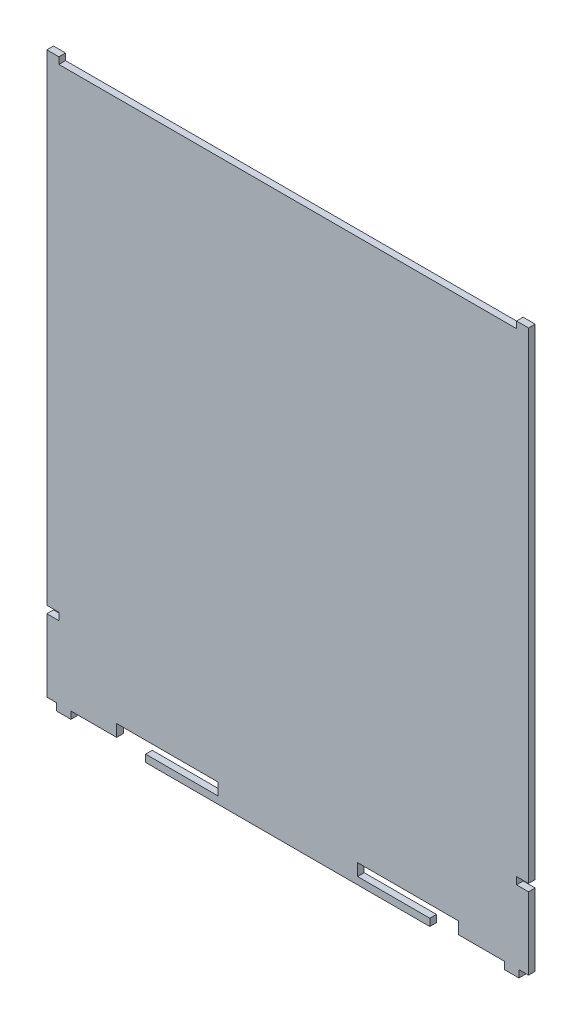
ISO-10303-21;
HEADER;
FILE_DESCRIPTION(('STEP AP214'),'2;1');
FILE_NAME('part.step','',(''),(''),'','','');
FILE_SCHEMA(('AUTOMOTIVE_DESIGN { 1 0 10303 214 1 1 1 1 }'));
ENDSEC;
DATA;
#1=APPLICATION_CONTEXT('core data for automotive mechanical design processes');
#2=APPLICATION_PROTOCOL_DEFINITION('international standard','automotive_design',2000,#1);
#3=PRODUCT_CONTEXT('',#1,'mechanical');
#4=PRODUCT('Part','Part','',(#3));
#5=PRODUCT_RELATED_PRODUCT_CATEGORY('part','',(#4));
#6=PRODUCT_DEFINITION_FORMATION('','',#4);
#7=PRODUCT_DEFINITION_CONTEXT('part definition',#1,'design');
#8=PRODUCT_DEFINITION('design','',#6,#7);
#9=PRODUCT_DEFINITION_SHAPE('','',#8);
#10=(LENGTH_UNIT() NAMED_UNIT(*) SI_UNIT(.MILLI.,.METRE.));
#11=(NAMED_UNIT(*) PLANE_ANGLE_UNIT() SI_UNIT($,.RADIAN.));
#12=(NAMED_UNIT(*) SI_UNIT($,.STERADIAN.) SOLID_ANGLE_UNIT());
#13=UNCERTAINTY_MEASURE_WITH_UNIT(LENGTH_MEASURE(1.E-05),#10,'distance_accuracy_value','');
#14=(GEOMETRIC_REPRESENTATION_CONTEXT(3) GLOBAL_UNCERTAINTY_ASSIGNED_CONTEXT((#13)) GLOBAL_UNIT_ASSIGNED_CONTEXT((#10,
#11,#12)) REPRESENTATION_CONTEXT('',''));
#15=CARTESIAN_POINT('',(0.,0.,0.));
#16=DIRECTION('',(0.,0.,1.));
#17=DIRECTION('',(1.,0.,0.));
#18=AXIS2_PLACEMENT_3D('',#15,#16,#17);
#19=CARTESIAN_POINT('',(200.,0.,2.75));
#20=DIRECTION('',(-1.,0.,0.));
#21=DIRECTION('',(0.,0.,1.));
#22=AXIS2_PLACEMENT_3D('',#19,#20,#21);
#23=PLANE('',#22);
#24=DIRECTION('',(0.,1.,0.));
#25=VECTOR('',#24,1.);
#26=CARTESIAN_POINT('',(200.,0.,0.));
#27=LINE('',#26,#25);
#28=CARTESIAN_POINT('',(200.,0.,0.));
#29=VERTEX_POINT('',#28);
#30=CARTESIAN_POINT('',(200.,30.,0.));
#31=VERTEX_POINT('',#30);
#32=EDGE_CURVE('E308',#29,#31,#27,.T.);
#33=ORIENTED_EDGE('',*,*,#32,.T.);
#34=DIRECTION('',(0.,0.,-1.));
#35=VECTOR('',#34,1.);
#36=CARTESIAN_POINT('',(200.,30.,2.75));
#37=LINE('',#36,#35);
#38=CARTESIAN_POINT('',(200.,30.,2.75));
#39=VERTEX_POINT('',#38);
#40=EDGE_CURVE('E11',#39,#31,#37,.T.);
#41=ORIENTED_EDGE('',*,*,#40,.F.);
#42=DIRECTION('',(0.,1.,0.));
#43=VECTOR('',#42,1.);
#44=CARTESIAN_POINT('',(200.,0.,2.75));
#45=LINE('',#44,#43);
#46=CARTESIAN_POINT('',(200.,0.,2.75));
#47=VERTEX_POINT('',#46);
#48=EDGE_CURVE('E434',#47,#39,#45,.T.);
#49=ORIENTED_EDGE('',*,*,#48,.F.);
#50=DIRECTION('',(0.,0.,-1.));
#51=VECTOR('',#50,1.);
#52=CARTESIAN_POINT('',(200.,0.,2.75));
#53=LINE('',#52,#51);
#54=EDGE_CURVE('E56',#47,#29,#53,.T.);
#55=ORIENTED_EDGE('',*,*,#54,.T.);
#56=EDGE_LOOP('',(#33,#41,#49,#55));
#57=FACE_BOUND('',#56,.T.);
#58=ADVANCED_FACE('F39',(#57),#23,.F.);
#59=CARTESIAN_POINT('',(0.,30.,2.75));
#60=DIRECTION('',(0.,-1.,0.));
#61=DIRECTION('',(0.,0.,-1.));
#62=AXIS2_PLACEMENT_3D('',#59,#60,#61);
#63=PLANE('',#62);
#64=DIRECTION('',(-1.,0.,0.));
#65=VECTOR('',#64,1.);
#66=CARTESIAN_POINT('',(0.,30.,0.));
#67=LINE('',#66,#65);
#68=CARTESIAN_POINT('',(195.,30.,0.));
#69=VERTEX_POINT('',#68);
#70=EDGE_CURVE('E311',#31,#69,#67,.T.);
#71=ORIENTED_EDGE('',*,*,#70,.T.);
#72=DIRECTION('',(0.,0.,-1.));
#73=VECTOR('',#72,1.);
#74=CARTESIAN_POINT('',(195.,30.,2.75));
#75=LINE('',#74,#73);
#76=CARTESIAN_POINT('',(195.,30.,2.75));
#77=VERTEX_POINT('',#76);
#78=EDGE_CURVE('E48',#77,#69,#75,.T.);
#79=ORIENTED_EDGE('',*,*,#78,.F.);
#80=DIRECTION('',(-1.,0.,0.));
#81=VECTOR('',#80,1.);
#82=CARTESIAN_POINT('',(0.,30.,2.75));
#83=LINE('',#82,#81);
#84=EDGE_CURVE('E178',#39,#77,#83,.T.);
#85=ORIENTED_EDGE('',*,*,#84,.F.);
#86=ORIENTED_EDGE('',*,*,#40,.T.);
#87=EDGE_LOOP('',(#71,#79,#85,#86));
#88=FACE_BOUND('',#87,.T.);
#89=ADVANCED_FACE('F684',(#88),#63,.F.);
#90=CARTESIAN_POINT('',(195.,0.,2.75));
#91=DIRECTION('',(-1.,0.,0.));
#92=DIRECTION('',(0.,0.,1.));
#93=AXIS2_PLACEMENT_3D('',#90,#91,#92);
#94=PLANE('',#93);
#95=DIRECTION('',(0.,1.,0.));
#96=VECTOR('',#95,1.);
#97=CARTESIAN_POINT('',(195.,0.,0.));
#98=LINE('',#97,#96);
#99=CARTESIAN_POINT('',(195.,33.,0.));
#100=VERTEX_POINT('',#99);
#101=EDGE_CURVE('E314',#69,#100,#98,.T.);
#102=ORIENTED_EDGE('',*,*,#101,.T.);
#103=DIRECTION('',(0.,0.,-1.));
#104=VECTOR('',#103,1.);
#105=CARTESIAN_POINT('',(195.,33.,2.75));
#106=LINE('',#105,#104);
#107=CARTESIAN_POINT('',(195.,33.,2.75));
#108=VERTEX_POINT('',#107);
#109=EDGE_CURVE('E540',#108,#100,#106,.T.);
#110=ORIENTED_EDGE('',*,*,#109,.F.);
#111=DIRECTION('',(0.,1.,0.));
#112=VECTOR('',#111,1.);
#113=CARTESIAN_POINT('',(195.,0.,2.75));
#114=LINE('',#113,#112);
#115=EDGE_CURVE('E550',#77,#108,#114,.T.);
#116=ORIENTED_EDGE('',*,*,#115,.F.);
#117=ORIENTED_EDGE('',*,*,#78,.T.);
#118=EDGE_LOOP('',(#102,#110,#116,#117));
#119=FACE_BOUND('',#118,.T.);
#120=ADVANCED_FACE('F548',(#119),#94,.F.);
#121=CARTESIAN_POINT('',(0.,33.,2.75));
#122=DIRECTION('',(0.,1.,0.));
#123=DIRECTION('',(0.,0.,1.));
#124=AXIS2_PLACEMENT_3D('',#121,#122,#123);
#125=PLANE('',#124);
#126=DIRECTION('',(1.,0.,0.));
#127=VECTOR('',#126,1.);
#128=CARTESIAN_POINT('',(0.,33.,0.));
#129=LINE('',#128,#127);
#130=CARTESIAN_POINT('',(200.,33.,0.));
#131=VERTEX_POINT('',#130);
#132=EDGE_CURVE('E317',#100,#131,#129,.T.);
#133=ORIENTED_EDGE('',*,*,#132,.T.);
#134=DIRECTION('',(0.,0.,-1.));
#135=VECTOR('',#134,1.);
#136=CARTESIAN_POINT('',(200.,33.,2.75));
#137=LINE('',#136,#135);
#138=CARTESIAN_POINT('',(200.,33.,2.75));
#139=VERTEX_POINT('',#138);
#140=EDGE_CURVE('E536',#139,#131,#137,.T.);
#141=ORIENTED_EDGE('',*,*,#140,.F.);
#142=DIRECTION('',(1.,0.,0.));
#143=VECTOR('',#142,1.);
#144=CARTESIAN_POINT('',(0.,33.,2.75));
#145=LINE('',#144,#143);
#146=EDGE_CURVE('E568',#108,#139,#145,.T.);
#147=ORIENTED_EDGE('',*,*,#146,.F.);
#148=ORIENTED_EDGE('',*,*,#109,.T.);
#149=EDGE_LOOP('',(#133,#141,#147,#148));
#150=FACE_BOUND('',#149,.T.);
#151=ADVANCED_FACE('F558',(#150),#125,.F.);
#152=CARTESIAN_POINT('',(200.,0.,2.75));
#153=DIRECTION('',(-1.,0.,0.));
#154=DIRECTION('',(0.,0.,1.));
#155=AXIS2_PLACEMENT_3D('',#152,#153,#154);
#156=PLANE('',#155);
#157=DIRECTION('',(0.,1.,0.));
#158=VECTOR('',#157,1.);
#159=CARTESIAN_POINT('',(200.,0.,0.));
#160=LINE('',#159,#158);
#161=CARTESIAN_POINT('',(200.,232.75,0.));
#162=VERTEX_POINT('',#161);
#163=EDGE_CURVE('E320',#131,#162,#160,.T.);
#164=ORIENTED_EDGE('',*,*,#163,.T.);
#165=DIRECTION('',(0.,0.,-1.));
#166=VECTOR('',#165,1.);
#167=CARTESIAN_POINT('',(200.,232.75,2.75));
#168=LINE('',#167,#166);
#169=CARTESIAN_POINT('',(200.,232.75,2.75));
#170=VERTEX_POINT('',#169);
#171=EDGE_CURVE('E532',#170,#162,#168,.T.);
#172=ORIENTED_EDGE('',*,*,#171,.F.);
#173=DIRECTION('',(0.,1.,0.));
#174=VECTOR('',#173,1.);
#175=CARTESIAN_POINT('',(200.,0.,2.75));
#176=LINE('',#175,#174);
#177=EDGE_CURVE('E564',#139,#170,#176,.T.);
#178=ORIENTED_EDGE('',*,*,#177,.F.);
#179=ORIENTED_EDGE('',*,*,#140,.T.);
#180=EDGE_LOOP('',(#164,#172,#178,#179));
#181=FACE_BOUND('',#180,.T.);
#182=ADVANCED_FACE('F562',(#181),#156,.F.);
#183=CARTESIAN_POINT('',(0.,232.75,2.75));
#184=DIRECTION('',(0.,-1.,0.));
#185=DIRECTION('',(0.,0.,-1.));
#186=AXIS2_PLACEMENT_3D('',#183,#184,#185);
#187=PLANE('',#186);
#188=DIRECTION('',(-1.,0.,0.));
#189=VECTOR('',#188,1.);
#190=CARTESIAN_POINT('',(0.,232.75,0.));
#191=LINE('',#190,#189);
#192=CARTESIAN_POINT('',(195.,232.75,0.));
#193=VERTEX_POINT('',#192);
#194=EDGE_CURVE('E323',#162,#193,#191,.T.);
#195=ORIENTED_EDGE('',*,*,#194,.T.);
#196=DIRECTION('',(0.,0.,-1.));
#197=VECTOR('',#196,1.);
#198=CARTESIAN_POINT('',(195.,232.75,2.75));
#199=LINE('',#198,#197);
#200=CARTESIAN_POINT('',(195.,232.75,2.75));
#201=VERTEX_POINT('',#200);
#202=EDGE_CURVE('E528',#201,#193,#199,.T.);
#203=ORIENTED_EDGE('',*,*,#202,.F.);
#204=DIRECTION('',(-1.,0.,0.));
#205=VECTOR('',#204,1.);
#206=CARTESIAN_POINT('',(0.,232.75,2.75));
#207=LINE('',#206,#205);
#208=EDGE_CURVE('E567',#170,#201,#207,.T.);
#209=ORIENTED_EDGE('',*,*,#208,.F.);
#210=ORIENTED_EDGE('',*,*,#171,.T.);
#211=EDGE_LOOP('',(#195,#203,#209,#210));
#212=FACE_BOUND('',#211,.T.);
#213=ADVANCED_FACE('F703',(#212),#187,.F.);
#214=CARTESIAN_POINT('',(195.,0.,2.75));
#215=DIRECTION('',(1.,0.,0.));
#216=DIRECTION('',(0.,0.,-1.));
#217=AXIS2_PLACEMENT_3D('',#214,#215,#216);
#218=PLANE('',#217);
#219=DIRECTION('',(0.,-1.,0.));
#220=VECTOR('',#219,1.);
#221=CARTESIAN_POINT('',(195.,0.,0.));
#222=LINE('',#221,#220);
#223=CARTESIAN_POINT('',(195.,230.,0.));
#224=VERTEX_POINT('',#223);
#225=EDGE_CURVE('E326',#193,#224,#222,.T.);
#226=ORIENTED_EDGE('',*,*,#225,.T.);
#227=DIRECTION('',(0.,0.,-1.));
#228=VECTOR('',#227,1.);
#229=CARTESIAN_POINT('',(195.,230.,2.75));
#230=LINE('',#229,#228);
#231=CARTESIAN_POINT('',(195.,230.,2.75));
#232=VERTEX_POINT('',#231);
#233=EDGE_CURVE('E525',#232,#224,#230,.T.);
#234=ORIENTED_EDGE('',*,*,#233,.F.);
#235=DIRECTION('',(0.,-1.,0.));
#236=VECTOR('',#235,1.);
#237=CARTESIAN_POINT('',(195.,0.,2.75));
#238=LINE('',#237,#236);
#239=EDGE_CURVE('E572',#201,#232,#238,.T.);
#240=ORIENTED_EDGE('',*,*,#239,.F.);
#241=ORIENTED_EDGE('',*,*,#202,.T.);
#242=EDGE_LOOP('',(#226,#234,#240,#241));
#243=FACE_BOUND('',#242,.T.);
#244=ADVANCED_FACE('F706',(#243),#218,.F.);
#245=CARTESIAN_POINT('',(0.,230.,2.75));
#246=DIRECTION('',(0.,1.,0.));
#247=DIRECTION('',(0.,0.,1.));
#248=AXIS2_PLACEMENT_3D('',#245,#246,#247);
#249=PLANE('',#248);
#250=DIRECTION('',(1.,0.,0.));
#251=VECTOR('',#250,1.);
#252=CARTESIAN_POINT('',(0.,230.,0.));
#253=LINE('',#252,#251);
#254=CARTESIAN_POINT('',(5.,230.,0.));
#255=VERTEX_POINT('',#254);
#256=EDGE_CURVE('E330',#255,#224,#253,.T.);
#257=ORIENTED_EDGE('',*,*,#256,.F.);
#258=DIRECTION('',(0.,0.,-1.));
#259=VECTOR('',#258,1.);
#260=CARTESIAN_POINT('',(5.,230.,2.75));
#261=LINE('',#260,#259);
#262=CARTESIAN_POINT('',(5.,230.,2.75));
#263=VERTEX_POINT('',#262);
#264=EDGE_CURVE('E522',#263,#255,#261,.T.);
#265=ORIENTED_EDGE('',*,*,#264,.F.);
#266=DIRECTION('',(1.,0.,0.));
#267=VECTOR('',#266,1.);
#268=CARTESIAN_POINT('',(0.,230.,2.75));
#269=LINE('',#268,#267);
#270=EDGE_CURVE('E579',#263,#232,#269,.T.);
#271=ORIENTED_EDGE('',*,*,#270,.T.);
#272=ORIENTED_EDGE('',*,*,#233,.T.);
#273=EDGE_LOOP('',(#257,#265,#271,#272));
#274=FACE_BOUND('',#273,.T.);
#275=ADVANCED_FACE('F710',(#274),#249,.T.);
#276=CARTESIAN_POINT('',(5.,0.,2.75));
#277=DIRECTION('',(1.,0.,0.));
#278=DIRECTION('',(0.,0.,-1.));
#279=AXIS2_PLACEMENT_3D('',#276,#277,#278);
#280=PLANE('',#279);
#281=DIRECTION('',(0.,-1.,0.));
#282=VECTOR('',#281,1.);
#283=CARTESIAN_POINT('',(5.,0.,0.));
#284=LINE('',#283,#282);
#285=CARTESIAN_POINT('',(5.,232.75,0.));
#286=VERTEX_POINT('',#285);
#287=EDGE_CURVE('E334',#286,#255,#284,.T.);
#288=ORIENTED_EDGE('',*,*,#287,.F.);
#289=DIRECTION('',(0.,0.,-1.));
#290=VECTOR('',#289,1.);
#291=CARTESIAN_POINT('',(5.,232.75,2.75));
#292=LINE('',#291,#290);
#293=CARTESIAN_POINT('',(5.,232.75,2.75));
#294=VERTEX_POINT('',#293);
#295=EDGE_CURVE('E519',#294,#286,#292,.T.);
#296=ORIENTED_EDGE('',*,*,#295,.F.);
#297=DIRECTION('',(0.,-1.,0.));
#298=VECTOR('',#297,1.);
#299=CARTESIAN_POINT('',(5.,0.,2.75));
#300=LINE('',#299,#298);
#301=EDGE_CURVE('E583',#294,#263,#300,.T.);
#302=ORIENTED_EDGE('',*,*,#301,.T.);
#303=ORIENTED_EDGE('',*,*,#264,.T.);
#304=EDGE_LOOP('',(#288,#296,#302,#303));
#305=FACE_BOUND('',#304,.T.);
#306=ADVANCED_FACE('F714',(#305),#280,.T.);
#307=CARTESIAN_POINT('',(0.,232.75,2.75));
#308=DIRECTION('',(0.,1.,0.));
#309=DIRECTION('',(0.,0.,1.));
#310=AXIS2_PLACEMENT_3D('',#307,#308,#309);
#311=PLANE('',#310);
#312=DIRECTION('',(1.,0.,0.));
#313=VECTOR('',#312,1.);
#314=CARTESIAN_POINT('',(0.,232.75,0.));
#315=LINE('',#314,#313);
#316=CARTESIAN_POINT('',(0.,232.75,0.));
#317=VERTEX_POINT('',#316);
#318=EDGE_CURVE('E338',#317,#286,#315,.T.);
#319=ORIENTED_EDGE('',*,*,#318,.F.);
#320=DIRECTION('',(0.,0.,-1.));
#321=VECTOR('',#320,1.);
#322=CARTESIAN_POINT('',(0.,232.75,2.75));
#323=LINE('',#322,#321);
#324=CARTESIAN_POINT('',(0.,232.75,2.75));
#325=VERTEX_POINT('',#324);
#326=EDGE_CURVE('E516',#325,#317,#323,.T.);
#327=ORIENTED_EDGE('',*,*,#326,.F.);
#328=DIRECTION('',(1.,0.,0.));
#329=VECTOR('',#328,1.);
#330=CARTESIAN_POINT('',(0.,232.75,2.75));
#331=LINE('',#330,#329);
#332=EDGE_CURVE('E587',#325,#294,#331,.T.);
#333=ORIENTED_EDGE('',*,*,#332,.T.);
#334=ORIENTED_EDGE('',*,*,#295,.T.);
#335=EDGE_LOOP('',(#319,#327,#333,#334));
#336=FACE_BOUND('',#335,.T.);
#337=ADVANCED_FACE('F718',(#336),#311,.T.);
#338=CARTESIAN_POINT('',(0.,0.,2.75));
#339=DIRECTION('',(-1.,0.,0.));
#340=DIRECTION('',(0.,0.,1.));
#341=AXIS2_PLACEMENT_3D('',#338,#339,#340);
#342=PLANE('',#341);
#343=DIRECTION('',(0.,1.,0.));
#344=VECTOR('',#343,1.);
#345=CARTESIAN_POINT('',(0.,0.,0.));
#346=LINE('',#345,#344);
#347=CARTESIAN_POINT('',(0.,33.,0.));
#348=VERTEX_POINT('',#347);
#349=EDGE_CURVE('E342',#348,#317,#346,.T.);
#350=ORIENTED_EDGE('',*,*,#349,.F.);
#351=DIRECTION('',(0.,0.,-1.));
#352=VECTOR('',#351,1.);
#353=CARTESIAN_POINT('',(0.,33.,2.75));
#354=LINE('',#353,#352);
#355=CARTESIAN_POINT('',(0.,33.,2.75));
#356=VERTEX_POINT('',#355);
#357=EDGE_CURVE('E513',#356,#348,#354,.T.);
#358=ORIENTED_EDGE('',*,*,#357,.F.);
#359=DIRECTION('',(0.,1.,0.));
#360=VECTOR('',#359,1.);
#361=CARTESIAN_POINT('',(0.,0.,2.75));
#362=LINE('',#361,#360);
#363=EDGE_CURVE('E591',#356,#325,#362,.T.);
#364=ORIENTED_EDGE('',*,*,#363,.T.);
#365=ORIENTED_EDGE('',*,*,#326,.T.);
#366=EDGE_LOOP('',(#350,#358,#364,#365));
#367=FACE_BOUND('',#366,.T.);
#368=ADVANCED_FACE('F722',(#367),#342,.T.);
#369=CARTESIAN_POINT('',(0.,33.,2.75));
#370=DIRECTION('',(0.,-1.,0.));
#371=DIRECTION('',(0.,0.,-1.));
#372=AXIS2_PLACEMENT_3D('',#369,#370,#371);
#373=PLANE('',#372);
#374=DIRECTION('',(-1.,0.,0.));
#375=VECTOR('',#374,1.);
#376=CARTESIAN_POINT('',(0.,33.,0.));
#377=LINE('',#376,#375);
#378=CARTESIAN_POINT('',(5.,33.,0.));
#379=VERTEX_POINT('',#378);
#380=EDGE_CURVE('E346',#379,#348,#377,.T.);
#381=ORIENTED_EDGE('',*,*,#380,.F.);
#382=DIRECTION('',(0.,0.,-1.));
#383=VECTOR('',#382,1.);
#384=CARTESIAN_POINT('',(5.,33.,2.75));
#385=LINE('',#384,#383);
#386=CARTESIAN_POINT('',(5.,33.,2.75));
#387=VERTEX_POINT('',#386);
#388=EDGE_CURVE('E510',#387,#379,#385,.T.);
#389=ORIENTED_EDGE('',*,*,#388,.F.);
#390=DIRECTION('',(-1.,0.,0.));
#391=VECTOR('',#390,1.);
#392=CARTESIAN_POINT('',(0.,33.,2.75));
#393=LINE('',#392,#391);
#394=EDGE_CURVE('E595',#387,#356,#393,.T.);
#395=ORIENTED_EDGE('',*,*,#394,.T.);
#396=ORIENTED_EDGE('',*,*,#357,.T.);
#397=EDGE_LOOP('',(#381,#389,#395,#396));
#398=FACE_BOUND('',#397,.T.);
#399=ADVANCED_FACE('F726',(#398),#373,.T.);
#400=CARTESIAN_POINT('',(5.,0.,2.75));
#401=DIRECTION('',(-1.,0.,0.));
#402=DIRECTION('',(0.,0.,1.));
#403=AXIS2_PLACEMENT_3D('',#400,#401,#402);
#404=PLANE('',#403);
#405=DIRECTION('',(0.,1.,0.));
#406=VECTOR('',#405,1.);
#407=CARTESIAN_POINT('',(5.,0.,0.));
#408=LINE('',#407,#406);
#409=CARTESIAN_POINT('',(5.,30.,0.));
#410=VERTEX_POINT('',#409);
#411=EDGE_CURVE('E350',#410,#379,#408,.T.);
#412=ORIENTED_EDGE('',*,*,#411,.F.);
#413=DIRECTION('',(0.,0.,-1.));
#414=VECTOR('',#413,1.);
#415=CARTESIAN_POINT('',(5.,30.,2.75));
#416=LINE('',#415,#414);
#417=CARTESIAN_POINT('',(5.,30.,2.75));
#418=VERTEX_POINT('',#417);
#419=EDGE_CURVE('E507',#418,#410,#416,.T.);
#420=ORIENTED_EDGE('',*,*,#419,.F.);
#421=DIRECTION('',(0.,1.,0.));
#422=VECTOR('',#421,1.);
#423=CARTESIAN_POINT('',(5.,0.,2.75));
#424=LINE('',#423,#422);
#425=EDGE_CURVE('E599',#418,#387,#424,.T.);
#426=ORIENTED_EDGE('',*,*,#425,.T.);
#427=ORIENTED_EDGE('',*,*,#388,.T.);
#428=EDGE_LOOP('',(#412,#420,#426,#427));
#429=FACE_BOUND('',#428,.T.);
#430=ADVANCED_FACE('F730',(#429),#404,.T.);
#431=CARTESIAN_POINT('',(0.,30.,2.75));
#432=DIRECTION('',(0.,1.,0.));
#433=DIRECTION('',(0.,0.,1.));
#434=AXIS2_PLACEMENT_3D('',#431,#432,#433);
#435=PLANE('',#434);
#436=DIRECTION('',(1.,0.,0.));
#437=VECTOR('',#436,1.);
#438=CARTESIAN_POINT('',(0.,30.,0.));
#439=LINE('',#438,#437);
#440=CARTESIAN_POINT('',(0.,30.,0.));
#441=VERTEX_POINT('',#440);
#442=EDGE_CURVE('E354',#441,#410,#439,.T.);
#443=ORIENTED_EDGE('',*,*,#442,.F.);
#444=DIRECTION('',(0.,0.,-1.));
#445=VECTOR('',#444,1.);
#446=CARTESIAN_POINT('',(0.,30.,2.75));
#447=LINE('',#446,#445);
#448=CARTESIAN_POINT('',(0.,30.,2.75));
#449=VERTEX_POINT('',#448);
#450=EDGE_CURVE('E504',#449,#441,#447,.T.);
#451=ORIENTED_EDGE('',*,*,#450,.F.);
#452=DIRECTION('',(1.,0.,0.));
#453=VECTOR('',#452,1.);
#454=CARTESIAN_POINT('',(0.,30.,2.75));
#455=LINE('',#454,#453);
#456=EDGE_CURVE('E603',#449,#418,#455,.T.);
#457=ORIENTED_EDGE('',*,*,#456,.T.);
#458=ORIENTED_EDGE('',*,*,#419,.T.);
#459=EDGE_LOOP('',(#443,#451,#457,#458));
#460=FACE_BOUND('',#459,.T.);
#461=ADVANCED_FACE('F734',(#460),#435,.T.);
#462=CARTESIAN_POINT('',(0.,0.,2.75));
#463=DIRECTION('',(-1.,0.,0.));
#464=DIRECTION('',(0.,0.,1.));
#465=AXIS2_PLACEMENT_3D('',#462,#463,#464);
#466=PLANE('',#465);
#467=DIRECTION('',(0.,1.,0.));
#468=VECTOR('',#467,1.);
#469=CARTESIAN_POINT('',(0.,0.,0.));
#470=LINE('',#469,#468);
#471=CARTESIAN_POINT('',(0.,0.,0.));
#472=VERTEX_POINT('',#471);
#473=EDGE_CURVE('E358',#472,#441,#470,.T.);
#474=ORIENTED_EDGE('',*,*,#473,.F.);
#475=DIRECTION('',(0.,0.,-1.));
#476=VECTOR('',#475,1.);
#477=CARTESIAN_POINT('',(0.,0.,2.75));
#478=LINE('',#477,#476);
#479=CARTESIAN_POINT('',(0.,0.,2.75));
#480=VERTEX_POINT('',#479);
#481=EDGE_CURVE('E501',#480,#472,#478,.T.);
#482=ORIENTED_EDGE('',*,*,#481,.F.);
#483=DIRECTION('',(0.,1.,0.));
#484=VECTOR('',#483,1.);
#485=CARTESIAN_POINT('',(0.,0.,2.75));
#486=LINE('',#485,#484);
#487=EDGE_CURVE('E607',#480,#449,#486,.T.);
#488=ORIENTED_EDGE('',*,*,#487,.T.);
#489=ORIENTED_EDGE('',*,*,#450,.T.);
#490=EDGE_LOOP('',(#474,#482,#488,#489));
#491=FACE_BOUND('',#490,.T.);
#492=ADVANCED_FACE('F738',(#491),#466,.T.);
#493=CARTESIAN_POINT('',(0.,0.,2.75));
#494=DIRECTION('',(0.,1.,0.));
#495=DIRECTION('',(0.,0.,1.));
#496=AXIS2_PLACEMENT_3D('',#493,#494,#495);
#497=PLANE('',#496);
#498=DIRECTION('',(1.,0.,0.));
#499=VECTOR('',#498,1.);
#500=CARTESIAN_POINT('',(0.,0.,0.));
#501=LINE('',#500,#499);
#502=CARTESIAN_POINT('',(4.,0.,0.));
#503=VERTEX_POINT('',#502);
#504=EDGE_CURVE('E362',#472,#503,#501,.T.);
#505=ORIENTED_EDGE('',*,*,#504,.T.);
#506=DIRECTION('',(0.,0.,-1.));
#507=VECTOR('',#506,1.);
#508=CARTESIAN_POINT('',(4.,0.,2.75));
#509=LINE('',#508,#507);
#510=CARTESIAN_POINT('',(4.,0.,2.75));
#511=VERTEX_POINT('',#510);
#512=EDGE_CURVE('E497',#511,#503,#509,.T.);
#513=ORIENTED_EDGE('',*,*,#512,.F.);
#514=DIRECTION('',(1.,0.,0.));
#515=VECTOR('',#514,1.);
#516=CARTESIAN_POINT('',(0.,0.,2.75));
#517=LINE('',#516,#515);
#518=EDGE_CURVE('E611',#480,#511,#517,.T.);
#519=ORIENTED_EDGE('',*,*,#518,.F.);
#520=ORIENTED_EDGE('',*,*,#481,.T.);
#521=EDGE_LOOP('',(#505,#513,#519,#520));
#522=FACE_BOUND('',#521,.T.);
#523=ADVANCED_FACE('F742',(#522),#497,.F.);
#524=CARTESIAN_POINT('',(4.,0.,2.75));
#525=DIRECTION('',(1.,0.,0.));
#526=DIRECTION('',(0.,0.,-1.));
#527=AXIS2_PLACEMENT_3D('',#524,#525,#526);
#528=PLANE('',#527);
#529=DIRECTION('',(0.,-1.,0.));
#530=VECTOR('',#529,1.);
#531=CARTESIAN_POINT('',(4.,0.,0.));
#532=LINE('',#531,#530);
#533=CARTESIAN_POINT('',(4.,-3.,0.));
#534=VERTEX_POINT('',#533);
#535=EDGE_CURVE('E365',#503,#534,#532,.T.);
#536=ORIENTED_EDGE('',*,*,#535,.T.);
#537=DIRECTION('',(0.,0.,-1.));
#538=VECTOR('',#537,1.);
#539=CARTESIAN_POINT('',(4.,-3.,2.75));
#540=LINE('',#539,#538);
#541=CARTESIAN_POINT('',(4.,-3.,2.75));
#542=VERTEX_POINT('',#541);
#543=EDGE_CURVE('E493',#542,#534,#540,.T.);
#544=ORIENTED_EDGE('',*,*,#543,.F.);
#545=DIRECTION('',(0.,-1.,0.));
#546=VECTOR('',#545,1.);
#547=CARTESIAN_POINT('',(4.,0.,2.75));
#548=LINE('',#547,#546);
#549=EDGE_CURVE('E614',#511,#542,#548,.T.);
#550=ORIENTED_EDGE('',*,*,#549,.F.);
#551=ORIENTED_EDGE('',*,*,#512,.T.);
#552=EDGE_LOOP('',(#536,#544,#550,#551));
#553=FACE_BOUND('',#552,.T.);
#554=ADVANCED_FACE('F746',(#553),#528,.F.);
#555=CARTESIAN_POINT('',(0.,-3.,2.75));
#556=DIRECTION('',(0.,1.,0.));
#557=DIRECTION('',(0.,0.,1.));
#558=AXIS2_PLACEMENT_3D('',#555,#556,#557);
#559=PLANE('',#558);
#560=DIRECTION('',(1.,0.,0.));
#561=VECTOR('',#560,1.);
#562=CARTESIAN_POINT('',(0.,-3.,0.));
#563=LINE('',#562,#561);
#564=CARTESIAN_POINT('',(10.,-3.,0.));
#565=VERTEX_POINT('',#564);
#566=EDGE_CURVE('E368',#534,#565,#563,.T.);
#567=ORIENTED_EDGE('',*,*,#566,.T.);
#568=DIRECTION('',(0.,0.,-1.));
#569=VECTOR('',#568,1.);
#570=CARTESIAN_POINT('',(10.,-3.,2.75));
#571=LINE('',#570,#569);
#572=CARTESIAN_POINT('',(10.,-3.,2.75));
#573=VERTEX_POINT('',#572);
#574=EDGE_CURVE('E489',#573,#565,#571,.T.);
#575=ORIENTED_EDGE('',*,*,#574,.F.);
#576=DIRECTION('',(1.,0.,0.));
#577=VECTOR('',#576,1.);
#578=CARTESIAN_POINT('',(0.,-3.,2.75));
#579=LINE('',#578,#577);
#580=EDGE_CURVE('E617',#542,#573,#579,.T.);
#581=ORIENTED_EDGE('',*,*,#580,.F.);
#582=ORIENTED_EDGE('',*,*,#543,.T.);
#583=EDGE_LOOP('',(#567,#575,#581,#582));
#584=FACE_BOUND('',#583,.T.);
#585=ADVANCED_FACE('F750',(#584),#559,.F.);
#586=CARTESIAN_POINT('',(10.,0.,2.75));
#587=DIRECTION('',(-1.,0.,0.));
#588=DIRECTION('',(0.,0.,1.));
#589=AXIS2_PLACEMENT_3D('',#586,#587,#588);
#590=PLANE('',#589);
#591=DIRECTION('',(0.,1.,0.));
#592=VECTOR('',#591,1.);
#593=CARTESIAN_POINT('',(10.,0.,0.));
#594=LINE('',#593,#592);
#595=CARTESIAN_POINT('',(10.,0.,0.));
#596=VERTEX_POINT('',#595);
#597=EDGE_CURVE('E371',#565,#596,#594,.T.);
#598=ORIENTED_EDGE('',*,*,#597,.T.);
#599=DIRECTION('',(0.,0.,-1.));
#600=VECTOR('',#599,1.);
#601=CARTESIAN_POINT('',(10.,0.,2.75));
#602=LINE('',#601,#600);
#603=CARTESIAN_POINT('',(10.,0.,2.75));
#604=VERTEX_POINT('',#603);
#605=EDGE_CURVE('E485',#604,#596,#602,.T.);
#606=ORIENTED_EDGE('',*,*,#605,.F.);
#607=DIRECTION('',(0.,1.,0.));
#608=VECTOR('',#607,1.);
#609=CARTESIAN_POINT('',(10.,0.,2.75));
#610=LINE('',#609,#608);
#611=EDGE_CURVE('E620',#573,#604,#610,.T.);
#612=ORIENTED_EDGE('',*,*,#611,.F.);
#613=ORIENTED_EDGE('',*,*,#574,.T.);
#614=EDGE_LOOP('',(#598,#606,#612,#613));
#615=FACE_BOUND('',#614,.T.);
#616=ADVANCED_FACE('F754',(#615),#590,.F.);
#617=CARTESIAN_POINT('',(0.,0.,2.75));
#618=DIRECTION('',(0.,1.,0.));
#619=DIRECTION('',(0.,0.,1.));
#620=AXIS2_PLACEMENT_3D('',#617,#618,#619);
#621=PLANE('',#620);
#622=DIRECTION('',(1.,0.,0.));
#623=VECTOR('',#622,1.);
#624=CARTESIAN_POINT('',(0.,0.,0.));
#625=LINE('',#624,#623);
#626=CARTESIAN_POINT('',(29.,0.,0.));
#627=VERTEX_POINT('',#626);
#628=EDGE_CURVE('E374',#596,#627,#625,.T.);
#629=ORIENTED_EDGE('',*,*,#628,.T.);
#630=DIRECTION('',(0.,0.,-1.));
#631=VECTOR('',#630,1.);
#632=CARTESIAN_POINT('',(29.,0.,2.75));
#633=LINE('',#632,#631);
#634=CARTESIAN_POINT('',(29.,0.,2.75));
#635=VERTEX_POINT('',#634);
#636=EDGE_CURVE('E481',#635,#627,#633,.T.);
#637=ORIENTED_EDGE('',*,*,#636,.F.);
#638=DIRECTION('',(1.,0.,0.));
#639=VECTOR('',#638,1.);
#640=CARTESIAN_POINT('',(0.,0.,2.75));
#641=LINE('',#640,#639);
#642=EDGE_CURVE('E623',#604,#635,#641,.T.);
#643=ORIENTED_EDGE('',*,*,#642,.F.);
#644=ORIENTED_EDGE('',*,*,#605,.T.);
#645=EDGE_LOOP('',(#629,#637,#643,#644));
#646=FACE_BOUND('',#645,.T.);
#647=ADVANCED_FACE('F758',(#646),#621,.F.);
#648=CARTESIAN_POINT('',(29.,0.,2.75));
#649=DIRECTION('',(-1.,0.,0.));
#650=DIRECTION('',(0.,0.,1.));
#651=AXIS2_PLACEMENT_3D('',#648,#649,#650);
#652=PLANE('',#651);
#653=DIRECTION('',(0.,1.,0.));
#654=VECTOR('',#653,1.);
#655=CARTESIAN_POINT('',(29.,0.,0.));
#656=LINE('',#655,#654);
#657=CARTESIAN_POINT('',(29.,5.,0.));
#658=VERTEX_POINT('',#657);
#659=EDGE_CURVE('E377',#627,#658,#656,.T.);
#660=ORIENTED_EDGE('',*,*,#659,.T.);
#661=DIRECTION('',(0.,0.,-1.));
#662=VECTOR('',#661,1.);
#663=CARTESIAN_POINT('',(29.,5.,2.75));
#664=LINE('',#663,#662);
#665=CARTESIAN_POINT('',(29.,5.,2.75));
#666=VERTEX_POINT('',#665);
#667=EDGE_CURVE('E477',#666,#658,#664,.T.);
#668=ORIENTED_EDGE('',*,*,#667,.F.);
#669=DIRECTION('',(0.,1.,0.));
#670=VECTOR('',#669,1.);
#671=CARTESIAN_POINT('',(29.,0.,2.75));
#672=LINE('',#671,#670);
#673=EDGE_CURVE('E626',#635,#666,#672,.T.);
#674=ORIENTED_EDGE('',*,*,#673,.F.);
#675=ORIENTED_EDGE('',*,*,#636,.T.);
#676=EDGE_LOOP('',(#660,#668,#674,#675));
#677=FACE_BOUND('',#676,.T.);
#678=ADVANCED_FACE('F762',(#677),#652,.F.);
#679=CARTESIAN_POINT('',(0.,5.,2.75));
#680=DIRECTION('',(0.,1.,0.));
#681=DIRECTION('',(0.,0.,1.));
#682=AXIS2_PLACEMENT_3D('',#679,#680,#681);
#683=PLANE('',#682);
#684=DIRECTION('',(1.,0.,0.));
#685=VECTOR('',#684,1.);
#686=CARTESIAN_POINT('',(0.,5.,0.));
#687=LINE('',#686,#685);
#688=CARTESIAN_POINT('',(71.,5.,0.));
#689=VERTEX_POINT('',#688);
#690=EDGE_CURVE('E380',#658,#689,#687,.T.);
#691=ORIENTED_EDGE('',*,*,#690,.T.);
#692=DIRECTION('',(0.,0.,-1.));
#693=VECTOR('',#692,1.);
#694=CARTESIAN_POINT('',(71.,5.,2.75));
#695=LINE('',#694,#693);
#696=CARTESIAN_POINT('',(71.,5.,2.75));
#697=VERTEX_POINT('',#696);
#698=EDGE_CURVE('E473',#697,#689,#695,.T.);
#699=ORIENTED_EDGE('',*,*,#698,.F.);
#700=DIRECTION('',(1.,0.,0.));
#701=VECTOR('',#700,1.);
#702=CARTESIAN_POINT('',(0.,5.,2.75));
#703=LINE('',#702,#701);
#704=EDGE_CURVE('E629',#666,#697,#703,.T.);
#705=ORIENTED_EDGE('',*,*,#704,.F.);
#706=ORIENTED_EDGE('',*,*,#667,.T.);
#707=EDGE_LOOP('',(#691,#699,#705,#706));
#708=FACE_BOUND('',#707,.T.);
#709=ADVANCED_FACE('F766',(#708),#683,.F.);
#710=CARTESIAN_POINT('',(71.,0.,2.75));
#711=DIRECTION('',(1.,0.,0.));
#712=DIRECTION('',(0.,0.,-1.));
#713=AXIS2_PLACEMENT_3D('',#710,#711,#712);
#714=PLANE('',#713);
#715=DIRECTION('',(0.,-1.,0.));
#716=VECTOR('',#715,1.);
#717=CARTESIAN_POINT('',(71.,0.,0.));
#718=LINE('',#717,#716);
#719=CARTESIAN_POINT('',(71.,0.,0.));
#720=VERTEX_POINT('',#719);
#721=EDGE_CURVE('E383',#689,#720,#718,.T.);
#722=ORIENTED_EDGE('',*,*,#721,.T.);
#723=DIRECTION('',(0.,0.,-1.));
#724=VECTOR('',#723,1.);
#725=CARTESIAN_POINT('',(71.,0.,2.75));
#726=LINE('',#725,#724);
#727=CARTESIAN_POINT('',(71.,0.,2.75));
#728=VERTEX_POINT('',#727);
#729=EDGE_CURVE('E469',#728,#720,#726,.T.);
#730=ORIENTED_EDGE('',*,*,#729,.F.);
#731=DIRECTION('',(0.,-1.,0.));
#732=VECTOR('',#731,1.);
#733=CARTESIAN_POINT('',(71.,0.,2.75));
#734=LINE('',#733,#732);
#735=EDGE_CURVE('E632',#697,#728,#734,.T.);
#736=ORIENTED_EDGE('',*,*,#735,.F.);
#737=ORIENTED_EDGE('',*,*,#698,.T.);
#738=EDGE_LOOP('',(#722,#730,#736,#737));
#739=FACE_BOUND('',#738,.T.);
#740=ADVANCED_FACE('F770',(#739),#714,.F.);
#741=CARTESIAN_POINT('',(0.,0.,2.75));
#742=DIRECTION('',(0.,-1.,0.));
#743=DIRECTION('',(0.,0.,-1.));
#744=AXIS2_PLACEMENT_3D('',#741,#742,#743);
#745=PLANE('',#744);
#746=DIRECTION('',(-1.,0.,0.));
#747=VECTOR('',#746,1.);
#748=CARTESIAN_POINT('',(0.,0.,0.));
#749=LINE('',#748,#747);
#750=CARTESIAN_POINT('',(41.,0.,0.));
#751=VERTEX_POINT('',#750);
#752=EDGE_CURVE('E386',#720,#751,#749,.T.);
#753=ORIENTED_EDGE('',*,*,#752,.T.);
#754=DIRECTION('',(0.,0.,-1.));
#755=VECTOR('',#754,1.);
#756=CARTESIAN_POINT('',(41.,0.,2.75));
#757=LINE('',#756,#755);
#758=CARTESIAN_POINT('',(41.,0.,2.75));
#759=VERTEX_POINT('',#758);
#760=EDGE_CURVE('E465',#759,#751,#757,.T.);
#761=ORIENTED_EDGE('',*,*,#760,.F.);
#762=DIRECTION('',(-1.,0.,0.));
#763=VECTOR('',#762,1.);
#764=CARTESIAN_POINT('',(0.,0.,2.75));
#765=LINE('',#764,#763);
#766=EDGE_CURVE('E635',#728,#759,#765,.T.);
#767=ORIENTED_EDGE('',*,*,#766,.F.);
#768=ORIENTED_EDGE('',*,*,#729,.T.);
#769=EDGE_LOOP('',(#753,#761,#767,#768));
#770=FACE_BOUND('',#769,.T.);
#771=ADVANCED_FACE('F774',(#770),#745,.F.);
#772=CARTESIAN_POINT('',(41.,0.,2.75));
#773=DIRECTION('',(1.,0.,0.));
#774=DIRECTION('',(0.,1.,0.));
#775=AXIS2_PLACEMENT_3D('',#772,#773,#774);
#776=PLANE('',#775);
#777=DIRECTION('',(0.,-1.,0.));
#778=VECTOR('',#777,1.);
#779=CARTESIAN_POINT('',(41.,0.,0.));
#780=LINE('',#779,#778);
#781=CARTESIAN_POINT('',(41.,-3.,0.));
#782=VERTEX_POINT('',#781);
#783=EDGE_CURVE('E389',#751,#782,#780,.T.);
#784=ORIENTED_EDGE('',*,*,#783,.T.);
#785=DIRECTION('',(0.,0.,-1.));
#786=VECTOR('',#785,1.);
#787=CARTESIAN_POINT('',(41.,-3.,2.75));
#788=LINE('',#787,#786);
#789=CARTESIAN_POINT('',(41.,-3.,2.75));
#790=VERTEX_POINT('',#789);
#791=EDGE_CURVE('E462',#790,#782,#788,.T.);
#792=ORIENTED_EDGE('',*,*,#791,.F.);
#793=DIRECTION('',(0.,-1.,0.));
#794=VECTOR('',#793,1.);
#795=CARTESIAN_POINT('',(41.,0.,2.75));
#796=LINE('',#795,#794);
#797=EDGE_CURVE('E638',#759,#790,#796,.T.);
#798=ORIENTED_EDGE('',*,*,#797,.F.);
#799=ORIENTED_EDGE('',*,*,#760,.T.);
#800=EDGE_LOOP('',(#784,#792,#798,#799));
#801=FACE_BOUND('',#800,.T.);
#802=ADVANCED_FACE('F778',(#801),#776,.F.);
#803=CARTESIAN_POINT('',(0.,-3.,2.75));
#804=DIRECTION('',(0.,-1.,0.));
#805=DIRECTION('',(0.,0.,-1.));
#806=AXIS2_PLACEMENT_3D('',#803,#804,#805);
#807=PLANE('',#806);
#808=DIRECTION('',(-1.,0.,0.));
#809=VECTOR('',#808,1.);
#810=CARTESIAN_POINT('',(0.,-3.,0.));
#811=LINE('',#810,#809);
#812=CARTESIAN_POINT('',(159.,-3.,0.));
#813=VERTEX_POINT('',#812);
#814=EDGE_CURVE('E393',#813,#782,#811,.T.);
#815=ORIENTED_EDGE('',*,*,#814,.F.);
#816=DIRECTION('',(0.,0.,-1.));
#817=VECTOR('',#816,1.);
#818=CARTESIAN_POINT('',(159.,-3.,2.75));
#819=LINE('',#818,#817);
#820=CARTESIAN_POINT('',(159.,-3.,2.75));
#821=VERTEX_POINT('',#820);
#822=EDGE_CURVE('E459',#821,#813,#819,.T.);
#823=ORIENTED_EDGE('',*,*,#822,.F.);
#824=DIRECTION('',(-1.,0.,0.));
#825=VECTOR('',#824,1.);
#826=CARTESIAN_POINT('',(0.,-3.,2.75));
#827=LINE('',#826,#825);
#828=EDGE_CURVE('E641',#821,#790,#827,.T.);
#829=ORIENTED_EDGE('',*,*,#828,.T.);
#830=ORIENTED_EDGE('',*,*,#791,.T.);
#831=EDGE_LOOP('',(#815,#823,#829,#830));
#832=FACE_BOUND('',#831,.T.);
#833=ADVANCED_FACE('F782',(#832),#807,.T.);
#834=CARTESIAN_POINT('',(159.,0.,2.75));
#835=DIRECTION('',(1.,0.,0.));
#836=DIRECTION('',(0.,0.,-1.));
#837=AXIS2_PLACEMENT_3D('',#834,#835,#836);
#838=PLANE('',#837);
#839=DIRECTION('',(0.,-1.,0.));
#840=VECTOR('',#839,1.);
#841=CARTESIAN_POINT('',(159.,0.,0.));
#842=LINE('',#841,#840);
#843=CARTESIAN_POINT('',(159.,0.,0.));
#844=VERTEX_POINT('',#843);
#845=EDGE_CURVE('E397',#844,#813,#842,.T.);
#846=ORIENTED_EDGE('',*,*,#845,.F.);
#847=DIRECTION('',(0.,0.,-1.));
#848=VECTOR('',#847,1.);
#849=CARTESIAN_POINT('',(159.,0.,2.75));
#850=LINE('',#849,#848);
#851=CARTESIAN_POINT('',(159.,0.,2.75));
#852=VERTEX_POINT('',#851);
#853=EDGE_CURVE('E456',#852,#844,#850,.T.);
#854=ORIENTED_EDGE('',*,*,#853,.F.);
#855=DIRECTION('',(0.,-1.,0.));
#856=VECTOR('',#855,1.);
#857=CARTESIAN_POINT('',(159.,0.,2.75));
#858=LINE('',#857,#856);
#859=EDGE_CURVE('E645',#852,#821,#858,.T.);
#860=ORIENTED_EDGE('',*,*,#859,.T.);
#861=ORIENTED_EDGE('',*,*,#822,.T.);
#862=EDGE_LOOP('',(#846,#854,#860,#861));
#863=FACE_BOUND('',#862,.T.);
#864=ADVANCED_FACE('F786',(#863),#838,.T.);
#865=CARTESIAN_POINT('',(0.,0.,2.75));
#866=DIRECTION('',(0.,1.,0.));
#867=DIRECTION('',(0.,0.,1.));
#868=AXIS2_PLACEMENT_3D('',#865,#866,#867);
#869=PLANE('',#868);
#870=DIRECTION('',(1.,0.,0.));
#871=VECTOR('',#870,1.);
#872=CARTESIAN_POINT('',(0.,0.,0.));
#873=LINE('',#872,#871);
#874=CARTESIAN_POINT('',(129.,0.,0.));
#875=VERTEX_POINT('',#874);
#876=EDGE_CURVE('E401',#875,#844,#873,.T.);
#877=ORIENTED_EDGE('',*,*,#876,.F.);
#878=DIRECTION('',(0.,0.,-1.));
#879=VECTOR('',#878,1.);
#880=CARTESIAN_POINT('',(129.,0.,2.75));
#881=LINE('',#880,#879);
#882=CARTESIAN_POINT('',(129.,0.,2.75));
#883=VERTEX_POINT('',#882);
#884=EDGE_CURVE('E453',#883,#875,#881,.T.);
#885=ORIENTED_EDGE('',*,*,#884,.F.);
#886=DIRECTION('',(1.,0.,0.));
#887=VECTOR('',#886,1.);
#888=CARTESIAN_POINT('',(0.,0.,2.75));
#889=LINE('',#888,#887);
#890=EDGE_CURVE('E649',#883,#852,#889,.T.);
#891=ORIENTED_EDGE('',*,*,#890,.T.);
#892=ORIENTED_EDGE('',*,*,#853,.T.);
#893=EDGE_LOOP('',(#877,#885,#891,#892));
#894=FACE_BOUND('',#893,.T.);
#895=ADVANCED_FACE('F790',(#894),#869,.T.);
#896=CARTESIAN_POINT('',(129.,0.,2.75));
#897=DIRECTION('',(1.,0.,0.));
#898=DIRECTION('',(0.,0.,-1.));
#899=AXIS2_PLACEMENT_3D('',#896,#897,#898);
#900=PLANE('',#899);
#901=DIRECTION('',(0.,-1.,0.));
#902=VECTOR('',#901,1.);
#903=CARTESIAN_POINT('',(129.,0.,0.));
#904=LINE('',#903,#902);
#905=CARTESIAN_POINT('',(129.,5.,0.));
#906=VERTEX_POINT('',#905);
#907=EDGE_CURVE('E405',#906,#875,#904,.T.);
#908=ORIENTED_EDGE('',*,*,#907,.F.);
#909=DIRECTION('',(0.,0.,-1.));
#910=VECTOR('',#909,1.);
#911=CARTESIAN_POINT('',(129.,5.,2.75));
#912=LINE('',#911,#910);
#913=CARTESIAN_POINT('',(129.,5.,2.75));
#914=VERTEX_POINT('',#913);
#915=EDGE_CURVE('E450',#914,#906,#912,.T.);
#916=ORIENTED_EDGE('',*,*,#915,.F.);
#917=DIRECTION('',(0.,-1.,0.));
#918=VECTOR('',#917,1.);
#919=CARTESIAN_POINT('',(129.,0.,2.75));
#920=LINE('',#919,#918);
#921=EDGE_CURVE('E653',#914,#883,#920,.T.);
#922=ORIENTED_EDGE('',*,*,#921,.T.);
#923=ORIENTED_EDGE('',*,*,#884,.T.);
#924=EDGE_LOOP('',(#908,#916,#922,#923));
#925=FACE_BOUND('',#924,.T.);
#926=ADVANCED_FACE('F794',(#925),#900,.T.);
#927=CARTESIAN_POINT('',(0.,5.,2.75));
#928=DIRECTION('',(0.,-1.,0.));
#929=DIRECTION('',(0.,0.,-1.));
#930=AXIS2_PLACEMENT_3D('',#927,#928,#929);
#931=PLANE('',#930);
#932=DIRECTION('',(-1.,0.,0.));
#933=VECTOR('',#932,1.);
#934=CARTESIAN_POINT('',(0.,5.,0.));
#935=LINE('',#934,#933);
#936=CARTESIAN_POINT('',(171.,5.,0.));
#937=VERTEX_POINT('',#936);
#938=EDGE_CURVE('E409',#937,#906,#935,.T.);
#939=ORIENTED_EDGE('',*,*,#938,.F.);
#940=DIRECTION('',(0.,0.,-1.));
#941=VECTOR('',#940,1.);
#942=CARTESIAN_POINT('',(171.,5.,2.75));
#943=LINE('',#942,#941);
#944=CARTESIAN_POINT('',(171.,5.,2.75));
#945=VERTEX_POINT('',#944);
#946=EDGE_CURVE('E447',#945,#937,#943,.T.);
#947=ORIENTED_EDGE('',*,*,#946,.F.);
#948=DIRECTION('',(-1.,0.,0.));
#949=VECTOR('',#948,1.);
#950=CARTESIAN_POINT('',(0.,5.,2.75));
#951=LINE('',#950,#949);
#952=EDGE_CURVE('E657',#945,#914,#951,.T.);
#953=ORIENTED_EDGE('',*,*,#952,.T.);
#954=ORIENTED_EDGE('',*,*,#915,.T.);
#955=EDGE_LOOP('',(#939,#947,#953,#954));
#956=FACE_BOUND('',#955,.T.);
#957=ADVANCED_FACE('F798',(#956),#931,.T.);
#958=CARTESIAN_POINT('',(171.,0.,2.75));
#959=DIRECTION('',(-1.,0.,0.));
#960=DIRECTION('',(0.,0.,1.));
#961=AXIS2_PLACEMENT_3D('',#958,#959,#960);
#962=PLANE('',#961);
#963=DIRECTION('',(0.,1.,0.));
#964=VECTOR('',#963,1.);
#965=CARTESIAN_POINT('',(171.,0.,0.));
#966=LINE('',#965,#964);
#967=CARTESIAN_POINT('',(171.,0.,0.));
#968=VERTEX_POINT('',#967);
#969=EDGE_CURVE('E413',#968,#937,#966,.T.);
#970=ORIENTED_EDGE('',*,*,#969,.F.);
#971=DIRECTION('',(0.,0.,-1.));
#972=VECTOR('',#971,1.);
#973=CARTESIAN_POINT('',(171.,0.,2.75));
#974=LINE('',#973,#972);
#975=CARTESIAN_POINT('',(171.,0.,2.75));
#976=VERTEX_POINT('',#975);
#977=EDGE_CURVE('E444',#976,#968,#974,.T.);
#978=ORIENTED_EDGE('',*,*,#977,.F.);
#979=DIRECTION('',(0.,1.,0.));
#980=VECTOR('',#979,1.);
#981=CARTESIAN_POINT('',(171.,0.,2.75));
#982=LINE('',#981,#980);
#983=EDGE_CURVE('E661',#976,#945,#982,.T.);
#984=ORIENTED_EDGE('',*,*,#983,.T.);
#985=ORIENTED_EDGE('',*,*,#946,.T.);
#986=EDGE_LOOP('',(#970,#978,#984,#985));
#987=FACE_BOUND('',#986,.T.);
#988=ADVANCED_FACE('F802',(#987),#962,.T.);
#989=CARTESIAN_POINT('',(0.,0.,2.75));
#990=DIRECTION('',(0.,1.,0.));
#991=DIRECTION('',(0.,0.,1.));
#992=AXIS2_PLACEMENT_3D('',#989,#990,#991);
#993=PLANE('',#992);
#994=DIRECTION('',(1.,0.,0.));
#995=VECTOR('',#994,1.);
#996=CARTESIAN_POINT('',(0.,0.,0.));
#997=LINE('',#996,#995);
#998=CARTESIAN_POINT('',(190.,0.,0.));
#999=VERTEX_POINT('',#998);
#1000=EDGE_CURVE('E417',#968,#999,#997,.T.);
#1001=ORIENTED_EDGE('',*,*,#1000,.T.);
#1002=DIRECTION('',(0.,0.,-1.));
#1003=VECTOR('',#1002,1.);
#1004=CARTESIAN_POINT('',(190.,0.,2.75));
#1005=LINE('',#1004,#1003);
#1006=CARTESIAN_POINT('',(190.,0.,2.75));
#1007=VERTEX_POINT('',#1006);
#1008=EDGE_CURVE('E441',#1007,#999,#1005,.T.);
#1009=ORIENTED_EDGE('',*,*,#1008,.F.);
#1010=DIRECTION('',(1.,0.,0.));
#1011=VECTOR('',#1010,1.);
#1012=CARTESIAN_POINT('',(0.,0.,2.75));
#1013=LINE('',#1012,#1011);
#1014=EDGE_CURVE('E665',#976,#1007,#1013,.T.);
#1015=ORIENTED_EDGE('',*,*,#1014,.F.);
#1016=ORIENTED_EDGE('',*,*,#977,.T.);
#1017=EDGE_LOOP('',(#1001,#1009,#1015,#1016));
#1018=FACE_BOUND('',#1017,.T.);
#1019=ADVANCED_FACE('F806',(#1018),#993,.F.);
#1020=CARTESIAN_POINT('',(190.,0.,2.75));
#1021=DIRECTION('',(-1.,0.,0.));
#1022=DIRECTION('',(0.,0.,1.));
#1023=AXIS2_PLACEMENT_3D('',#1020,#1021,#1022);
#1024=PLANE('',#1023);
#1025=DIRECTION('',(0.,1.,0.));
#1026=VECTOR('',#1025,1.);
#1027=CARTESIAN_POINT('',(190.,0.,0.));
#1028=LINE('',#1027,#1026);
#1029=CARTESIAN_POINT('',(190.,-3.,0.));
#1030=VERTEX_POINT('',#1029);
#1031=EDGE_CURVE('E421',#1030,#999,#1028,.T.);
#1032=ORIENTED_EDGE('',*,*,#1031,.F.);
#1033=DIRECTION('',(0.,0.,-1.));
#1034=VECTOR('',#1033,1.);
#1035=CARTESIAN_POINT('',(190.,-3.,2.75));
#1036=LINE('',#1035,#1034);
#1037=CARTESIAN_POINT('',(190.,-3.,2.75));
#1038=VERTEX_POINT('',#1037);
#1039=EDGE_CURVE('E288',#1038,#1030,#1036,.T.);
#1040=ORIENTED_EDGE('',*,*,#1039,.F.);
#1041=DIRECTION('',(0.,1.,0.));
#1042=VECTOR('',#1041,1.);
#1043=CARTESIAN_POINT('',(190.,0.,2.75));
#1044=LINE('',#1043,#1042);
#1045=EDGE_CURVE('E297',#1038,#1007,#1044,.T.);
#1046=ORIENTED_EDGE('',*,*,#1045,.T.);
#1047=ORIENTED_EDGE('',*,*,#1008,.T.);
#1048=EDGE_LOOP('',(#1032,#1040,#1046,#1047));
#1049=FACE_BOUND('',#1048,.T.);
#1050=ADVANCED_FACE('F670',(#1049),#1024,.T.);
#1051=CARTESIAN_POINT('',(0.,-3.,2.75));
#1052=DIRECTION('',(0.,-1.,0.));
#1053=DIRECTION('',(0.,0.,-1.));
#1054=AXIS2_PLACEMENT_3D('',#1051,#1052,#1053);
#1055=PLANE('',#1054);
#1056=DIRECTION('',(-1.,0.,0.));
#1057=VECTOR('',#1056,1.);
#1058=CARTESIAN_POINT('',(0.,-3.,0.));
#1059=LINE('',#1058,#1057);
#1060=CARTESIAN_POINT('',(196.,-3.,0.));
#1061=VERTEX_POINT('',#1060);
#1062=EDGE_CURVE('E283',#1061,#1030,#1059,.T.);
#1063=ORIENTED_EDGE('',*,*,#1062,.F.);
#1064=DIRECTION('',(0.,0.,-1.));
#1065=VECTOR('',#1064,1.);
#1066=CARTESIAN_POINT('',(196.,-3.,2.75));
#1067=LINE('',#1066,#1065);
#1068=CARTESIAN_POINT('',(196.,-3.,2.75));
#1069=VERTEX_POINT('',#1068);
#1070=EDGE_CURVE('E278',#1069,#1061,#1067,.T.);
#1071=ORIENTED_EDGE('',*,*,#1070,.F.);
#1072=DIRECTION('',(-1.,0.,0.));
#1073=VECTOR('',#1072,1.);
#1074=CARTESIAN_POINT('',(0.,-3.,2.75));
#1075=LINE('',#1074,#1073);
#1076=EDGE_CURVE('E281',#1069,#1038,#1075,.T.);
#1077=ORIENTED_EDGE('',*,*,#1076,.T.);
#1078=ORIENTED_EDGE('',*,*,#1039,.T.);
#1079=EDGE_LOOP('',(#1063,#1071,#1077,#1078));
#1080=FACE_BOUND('',#1079,.T.);
#1081=ADVANCED_FACE('F280',(#1080),#1055,.T.);
#1082=CARTESIAN_POINT('',(196.,0.,2.75));
#1083=DIRECTION('',(1.,0.,0.));
#1084=DIRECTION('',(0.,0.,-1.));
#1085=AXIS2_PLACEMENT_3D('',#1082,#1083,#1084);
#1086=PLANE('',#1085);
#1087=DIRECTION('',(0.,-1.,0.));
#1088=VECTOR('',#1087,1.);
#1089=CARTESIAN_POINT('',(196.,0.,0.));
#1090=LINE('',#1089,#1088);
#1091=CARTESIAN_POINT('',(196.,0.,0.));
#1092=VERTEX_POINT('',#1091);
#1093=EDGE_CURVE('E427',#1092,#1061,#1090,.T.);
#1094=ORIENTED_EDGE('',*,*,#1093,.F.);
#1095=DIRECTION('',(0.,0.,-1.));
#1096=VECTOR('',#1095,1.);
#1097=CARTESIAN_POINT('',(196.,0.,2.75));
#1098=LINE('',#1097,#1096);
#1099=CARTESIAN_POINT('',(196.,0.,2.75));
#1100=VERTEX_POINT('',#1099);
#1101=EDGE_CURVE('E166',#1100,#1092,#1098,.T.);
#1102=ORIENTED_EDGE('',*,*,#1101,.F.);
#1103=DIRECTION('',(0.,-1.,0.));
#1104=VECTOR('',#1103,1.);
#1105=CARTESIAN_POINT('',(196.,0.,2.75));
#1106=LINE('',#1105,#1104);
#1107=EDGE_CURVE('E295',#1100,#1069,#1106,.T.);
#1108=ORIENTED_EDGE('',*,*,#1107,.T.);
#1109=ORIENTED_EDGE('',*,*,#1070,.T.);
#1110=EDGE_LOOP('',(#1094,#1102,#1108,#1109));
#1111=FACE_BOUND('',#1110,.T.);
#1112=ADVANCED_FACE('F300',(#1111),#1086,.T.);
#1113=CARTESIAN_POINT('',(0.,0.,2.75));
#1114=DIRECTION('',(0.,-1.,0.));
#1115=DIRECTION('',(0.,0.,-1.));
#1116=AXIS2_PLACEMENT_3D('',#1113,#1114,#1115);
#1117=PLANE('',#1116);
#1118=DIRECTION('',(-1.,0.,0.));
#1119=VECTOR('',#1118,1.);
#1120=CARTESIAN_POINT('',(0.,0.,0.));
#1121=LINE('',#1120,#1119);
#1122=EDGE_CURVE('E430',#29,#1092,#1121,.T.);
#1123=ORIENTED_EDGE('',*,*,#1122,.F.);
#1124=ORIENTED_EDGE('',*,*,#54,.F.);
#1125=DIRECTION('',(-1.,0.,0.));
#1126=VECTOR('',#1125,1.);
#1127=CARTESIAN_POINT('',(0.,0.,2.75));
#1128=LINE('',#1127,#1126);
#1129=EDGE_CURVE('E302',#47,#1100,#1128,.T.);
#1130=ORIENTED_EDGE('',*,*,#1129,.T.);
#1131=ORIENTED_EDGE('',*,*,#1101,.T.);
#1132=EDGE_LOOP('',(#1123,#1124,#1130,#1131));
#1133=FACE_BOUND('',#1132,.T.);
#1134=ADVANCED_FACE('F673',(#1133),#1117,.T.);
#1135=CARTESIAN_POINT('',(0.,0.,2.75));
#1136=DIRECTION('',(0.,0.,1.));
#1137=DIRECTION('',(1.,0.,0.));
#1138=AXIS2_PLACEMENT_3D('',#1135,#1136,#1137);
#1139=PLANE('',#1138);
#1140=ORIENTED_EDGE('',*,*,#48,.T.);
#1141=ORIENTED_EDGE('',*,*,#84,.T.);
#1142=ORIENTED_EDGE('',*,*,#115,.T.);
#1143=ORIENTED_EDGE('',*,*,#146,.T.);
#1144=ORIENTED_EDGE('',*,*,#177,.T.);
#1145=ORIENTED_EDGE('',*,*,#208,.T.);
#1146=ORIENTED_EDGE('',*,*,#239,.T.);
#1147=ORIENTED_EDGE('',*,*,#270,.F.);
#1148=ORIENTED_EDGE('',*,*,#301,.F.);
#1149=ORIENTED_EDGE('',*,*,#332,.F.);
#1150=ORIENTED_EDGE('',*,*,#363,.F.);
#1151=ORIENTED_EDGE('',*,*,#394,.F.);
#1152=ORIENTED_EDGE('',*,*,#425,.F.);
#1153=ORIENTED_EDGE('',*,*,#456,.F.);
#1154=ORIENTED_EDGE('',*,*,#487,.F.);
#1155=ORIENTED_EDGE('',*,*,#518,.T.);
#1156=ORIENTED_EDGE('',*,*,#549,.T.);
#1157=ORIENTED_EDGE('',*,*,#580,.T.);
#1158=ORIENTED_EDGE('',*,*,#611,.T.);
#1159=ORIENTED_EDGE('',*,*,#642,.T.);
#1160=ORIENTED_EDGE('',*,*,#673,.T.);
#1161=ORIENTED_EDGE('',*,*,#704,.T.);
#1162=ORIENTED_EDGE('',*,*,#735,.T.);
#1163=ORIENTED_EDGE('',*,*,#766,.T.);
#1164=ORIENTED_EDGE('',*,*,#797,.T.);
#1165=ORIENTED_EDGE('',*,*,#828,.F.);
#1166=ORIENTED_EDGE('',*,*,#859,.F.);
#1167=ORIENTED_EDGE('',*,*,#890,.F.);
#1168=ORIENTED_EDGE('',*,*,#921,.F.);
#1169=ORIENTED_EDGE('',*,*,#952,.F.);
#1170=ORIENTED_EDGE('',*,*,#983,.F.);
#1171=ORIENTED_EDGE('',*,*,#1014,.T.);
#1172=ORIENTED_EDGE('',*,*,#1045,.F.);
#1173=ORIENTED_EDGE('',*,*,#1076,.F.);
#1174=ORIENTED_EDGE('',*,*,#1107,.F.);
#1175=ORIENTED_EDGE('',*,*,#1129,.F.);
#1176=EDGE_LOOP('',(#1140,#1141,#1142,#1143,#1144,#1145,#1146,#1147,#1148,#1149,#1150,#1151,
#1152,#1153,#1154,#1155,#1156,#1157,#1158,#1159,#1160,#1161,#1162,#1163,#1164,#1165,#1166,#1167,
#1168,#1169,#1170,#1171,#1172,#1173,#1174,#1175));
#1177=FACE_BOUND('',#1176,.T.);
#1178=ADVANCED_FACE('F293',(#1177),#1139,.T.);
#1179=CARTESIAN_POINT('',(0.,0.,0.));
#1180=DIRECTION('',(0.,0.,1.));
#1181=DIRECTION('',(1.,0.,0.));
#1182=AXIS2_PLACEMENT_3D('',#1179,#1180,#1181);
#1183=PLANE('',#1182);
#1184=ORIENTED_EDGE('',*,*,#32,.F.);
#1185=ORIENTED_EDGE('',*,*,#1122,.T.);
#1186=ORIENTED_EDGE('',*,*,#1093,.T.);
#1187=ORIENTED_EDGE('',*,*,#1062,.T.);
#1188=ORIENTED_EDGE('',*,*,#1031,.T.);
#1189=ORIENTED_EDGE('',*,*,#1000,.F.);
#1190=ORIENTED_EDGE('',*,*,#969,.T.);
#1191=ORIENTED_EDGE('',*,*,#938,.T.);
#1192=ORIENTED_EDGE('',*,*,#907,.T.);
#1193=ORIENTED_EDGE('',*,*,#876,.T.);
#1194=ORIENTED_EDGE('',*,*,#845,.T.);
#1195=ORIENTED_EDGE('',*,*,#814,.T.);
#1196=ORIENTED_EDGE('',*,*,#783,.F.);
#1197=ORIENTED_EDGE('',*,*,#752,.F.);
#1198=ORIENTED_EDGE('',*,*,#721,.F.);
#1199=ORIENTED_EDGE('',*,*,#690,.F.);
#1200=ORIENTED_EDGE('',*,*,#659,.F.);
#1201=ORIENTED_EDGE('',*,*,#628,.F.);
#1202=ORIENTED_EDGE('',*,*,#597,.F.);
#1203=ORIENTED_EDGE('',*,*,#566,.F.);
#1204=ORIENTED_EDGE('',*,*,#535,.F.);
#1205=ORIENTED_EDGE('',*,*,#504,.F.);
#1206=ORIENTED_EDGE('',*,*,#473,.T.);
#1207=ORIENTED_EDGE('',*,*,#442,.T.);
#1208=ORIENTED_EDGE('',*,*,#411,.T.);
#1209=ORIENTED_EDGE('',*,*,#380,.T.);
#1210=ORIENTED_EDGE('',*,*,#349,.T.);
#1211=ORIENTED_EDGE('',*,*,#318,.T.);
#1212=ORIENTED_EDGE('',*,*,#287,.T.);
#1213=ORIENTED_EDGE('',*,*,#256,.T.);
#1214=ORIENTED_EDGE('',*,*,#225,.F.);
#1215=ORIENTED_EDGE('',*,*,#194,.F.);
#1216=ORIENTED_EDGE('',*,*,#163,.F.);
#1217=ORIENTED_EDGE('',*,*,#132,.F.);
#1218=ORIENTED_EDGE('',*,*,#101,.F.);
#1219=ORIENTED_EDGE('',*,*,#70,.F.);
#1220=EDGE_LOOP('',(#1184,#1185,#1186,#1187,#1188,#1189,#1190,#1191,#1192,#1193,#1194,#1195,
#1196,#1197,#1198,#1199,#1200,#1201,#1202,#1203,#1204,#1205,#1206,#1207,#1208,#1209,#1210,#1211,
#1212,#1213,#1214,#1215,#1216,#1217,#1218,#1219));
#1221=FACE_BOUND('',#1220,.T.);
#1222=ADVANCED_FACE('F553',(#1221),#1183,.F.);
#1223=CLOSED_SHELL('',(#58,#89,#120,#151,#182,#213,#244,#275,#306,#337,#368,#399,#430,#461,#492,
#523,#554,#585,#616,#647,#678,#709,#740,#771,#802,#833,#864,#895,#926,#957,#988,#1019,#1050,
#1081,#1112,#1134,#1178,#1222));
#1224=MANIFOLD_SOLID_BREP('B2',#1223);
#1225=ADVANCED_BREP_SHAPE_REPRESENTATION('',(#18,#1224),#14);
#1226=SHAPE_DEFINITION_REPRESENTATION(#9,#1225);
ENDSEC;
END-ISO-10303-21;
